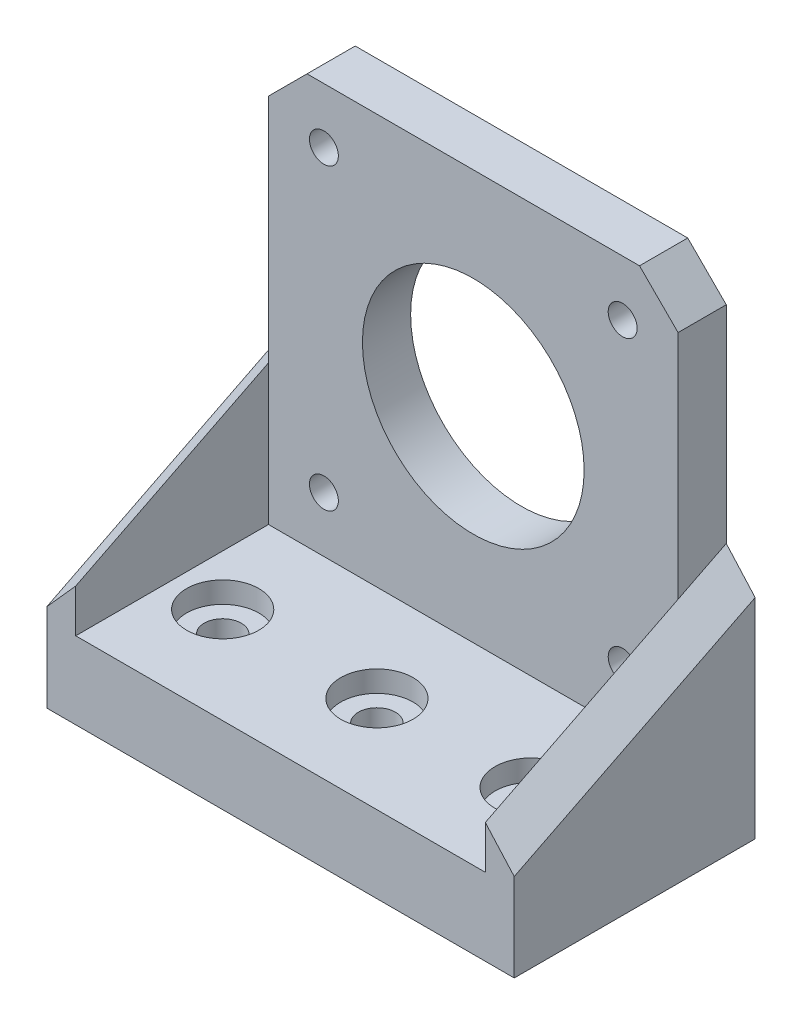
ISO-10303-21;
HEADER;
FILE_DESCRIPTION(('STEP AP214'),'2;1');
FILE_NAME('part.step','',(''),(''),'','','');
FILE_SCHEMA(('AUTOMOTIVE_DESIGN { 1 0 10303 214 1 1 1 1 }'));
ENDSEC;
DATA;
#1=APPLICATION_CONTEXT('core data for automotive mechanical design processes');
#2=APPLICATION_PROTOCOL_DEFINITION('international standard','automotive_design',2000,#1);
#3=PRODUCT_CONTEXT('',#1,'mechanical');
#4=PRODUCT('Part','Part','',(#3));
#5=PRODUCT_RELATED_PRODUCT_CATEGORY('part','',(#4));
#6=PRODUCT_DEFINITION_FORMATION('','',#4);
#7=PRODUCT_DEFINITION_CONTEXT('part definition',#1,'design');
#8=PRODUCT_DEFINITION('design','',#6,#7);
#9=PRODUCT_DEFINITION_SHAPE('','',#8);
#10=(LENGTH_UNIT() NAMED_UNIT(*) SI_UNIT(.MILLI.,.METRE.));
#11=(NAMED_UNIT(*) PLANE_ANGLE_UNIT() SI_UNIT($,.RADIAN.));
#12=(NAMED_UNIT(*) SI_UNIT($,.STERADIAN.) SOLID_ANGLE_UNIT());
#13=UNCERTAINTY_MEASURE_WITH_UNIT(LENGTH_MEASURE(1.E-05),#10,'distance_accuracy_value','');
#14=(GEOMETRIC_REPRESENTATION_CONTEXT(3) GLOBAL_UNCERTAINTY_ASSIGNED_CONTEXT((#13)) GLOBAL_UNIT_ASSIGNED_CONTEXT((#10,
#11,#12)) REPRESENTATION_CONTEXT('',''));
#15=CARTESIAN_POINT('',(0.,0.,0.));
#16=DIRECTION('',(0.,0.,1.));
#17=DIRECTION('',(1.,0.,0.));
#18=AXIS2_PLACEMENT_3D('',#15,#16,#17);
#19=CARTESIAN_POINT('',(21.25,-21.25,5.));
#20=DIRECTION('',(-1.,0.,0.));
#21=DIRECTION('',(0.,0.,1.));
#22=AXIS2_PLACEMENT_3D('',#19,#20,#21);
#23=PLANE('',#22);
#24=DIRECTION('',(0.,1.,0.));
#25=VECTOR('',#24,1.);
#26=CARTESIAN_POINT('',(21.25,-21.25,5.));
#27=LINE('',#26,#25);
#28=CARTESIAN_POINT('',(21.25,-6.71833827664875,5.));
#29=VERTEX_POINT('',#28);
#30=CARTESIAN_POINT('',(21.25,17.25,5.));
#31=VERTEX_POINT('',#30);
#32=EDGE_CURVE('E169',#29,#31,#27,.T.);
#33=ORIENTED_EDGE('',*,*,#32,.F.);
#34=DIRECTION('',(0.,0.449164856844313,-0.893448896902351));
#35=VECTOR('',#34,1.);
#36=CARTESIAN_POINT('',(21.25,-5.107918235039,1.79665942737727));
#37=LINE('',#36,#35);
#38=CARTESIAN_POINT('',(21.25,-4.20468104117844,0.));
#39=VERTEX_POINT('',#38);
#40=EDGE_CURVE('E150',#29,#39,#37,.T.);
#41=ORIENTED_EDGE('',*,*,#40,.T.);
#42=DIRECTION('',(0.,1.,0.));
#43=VECTOR('',#42,1.);
#44=CARTESIAN_POINT('',(21.25,-21.25,0.));
#45=LINE('',#44,#43);
#46=CARTESIAN_POINT('',(21.25,17.25,0.));
#47=VERTEX_POINT('',#46);
#48=EDGE_CURVE('E198',#39,#47,#45,.T.);
#49=ORIENTED_EDGE('',*,*,#48,.T.);
#50=DIRECTION('',(0.,0.,1.));
#51=VECTOR('',#50,1.);
#52=CARTESIAN_POINT('',(21.25,17.25,5.));
#53=LINE('',#52,#51);
#54=EDGE_CURVE('E172',#47,#31,#53,.T.);
#55=ORIENTED_EDGE('',*,*,#54,.T.);
#56=EDGE_LOOP('',(#33,#41,#49,#55));
#57=FACE_BOUND('',#56,.T.);
#58=ADVANCED_FACE('F43',(#57),#23,.F.);
#59=CARTESIAN_POINT('',(0.,0.,5.));
#60=DIRECTION('',(0.,0.,-1.));
#61=DIRECTION('',(-1.,0.,0.));
#62=AXIS2_PLACEMENT_3D('',#59,#60,#61);
#63=PLANE('',#62);
#64=DIRECTION('',(-1.,0.,0.));
#65=VECTOR('',#64,1.);
#66=CARTESIAN_POINT('',(-21.25,21.25,5.));
#67=LINE('',#66,#65);
#68=CARTESIAN_POINT('',(17.25,21.25,5.));
#69=VERTEX_POINT('',#68);
#70=CARTESIAN_POINT('',(-17.25,21.25,5.));
#71=VERTEX_POINT('',#70);
#72=EDGE_CURVE('E207',#69,#71,#67,.T.);
#73=ORIENTED_EDGE('',*,*,#72,.T.);
#74=DIRECTION('',(0.707106781186549,0.707106781186546,0.));
#75=VECTOR('',#74,1.);
#76=CARTESIAN_POINT('',(-21.25,17.25,5.));
#77=LINE('',#76,#75);
#78=CARTESIAN_POINT('',(-21.25,17.25,5.));
#79=VERTEX_POINT('',#78);
#80=EDGE_CURVE('E175',#71,#79,#77,.F.);
#81=ORIENTED_EDGE('',*,*,#80,.T.);
#82=DIRECTION('',(0.,-1.,0.));
#83=VECTOR('',#82,1.);
#84=CARTESIAN_POINT('',(-21.25,-21.25,5.));
#85=LINE('',#84,#83);
#86=CARTESIAN_POINT('',(-21.25,-6.71833827664871,5.));
#87=VERTEX_POINT('',#86);
#88=EDGE_CURVE('E204',#79,#87,#85,.T.);
#89=ORIENTED_EDGE('',*,*,#88,.T.);
#90=CARTESIAN_POINT('',(-21.25,-21.25,5.));
#91=VERTEX_POINT('',#90);
#92=EDGE_CURVE('E206',#87,#91,#85,.T.);
#93=ORIENTED_EDGE('',*,*,#92,.T.);
#94=DIRECTION('',(1.,0.,0.));
#95=VECTOR('',#94,1.);
#96=CARTESIAN_POINT('',(-21.25,-21.25,5.));
#97=LINE('',#96,#95);
#98=CARTESIAN_POINT('',(21.25,-21.25,5.));
#99=VERTEX_POINT('',#98);
#100=EDGE_CURVE('E194',#91,#99,#97,.T.);
#101=ORIENTED_EDGE('',*,*,#100,.T.);
#102=EDGE_CURVE('E210',#99,#29,#27,.T.);
#103=ORIENTED_EDGE('',*,*,#102,.T.);
#104=ORIENTED_EDGE('',*,*,#32,.T.);
#105=DIRECTION('',(0.707106781186546,-0.707106781186549,0.));
#106=VECTOR('',#105,1.);
#107=CARTESIAN_POINT('',(17.25,21.25,5.));
#108=LINE('',#107,#106);
#109=EDGE_CURVE('E180',#31,#69,#108,.F.);
#110=ORIENTED_EDGE('',*,*,#109,.T.);
#111=EDGE_LOOP('',(#73,#81,#89,#93,#101,#103,#104,#110));
#112=FACE_BOUND('',#111,.T.);
#113=CARTESIAN_POINT('',(15.5,15.5,5.));
#114=DIRECTION('',(0.,0.,1.));
#115=DIRECTION('',(1.,0.,0.));
#116=AXIS2_PLACEMENT_3D('',#113,#114,#115);
#117=CIRCLE('',#116,1.5);
#118=CARTESIAN_POINT('',(17.,15.5,5.));
#119=VERTEX_POINT('',#118);
#120=EDGE_CURVE('E201',#119,#119,#117,.T.);
#121=ORIENTED_EDGE('',*,*,#120,.F.);
#122=EDGE_LOOP('',(#121));
#123=FACE_BOUND('',#122,.T.);
#124=CARTESIAN_POINT('',(-15.5,15.5,5.));
#125=DIRECTION('',(0.,0.,1.));
#126=DIRECTION('',(-1.,0.,0.));
#127=AXIS2_PLACEMENT_3D('',#124,#125,#126);
#128=CIRCLE('',#127,1.5);
#129=CARTESIAN_POINT('',(-17.,15.5,5.));
#130=VERTEX_POINT('',#129);
#131=EDGE_CURVE('E215',#130,#130,#128,.T.);
#132=ORIENTED_EDGE('',*,*,#131,.F.);
#133=EDGE_LOOP('',(#132));
#134=FACE_BOUND('',#133,.T.);
#135=CARTESIAN_POINT('',(15.5,-15.5,5.));
#136=DIRECTION('',(0.,0.,1.));
#137=DIRECTION('',(-1.,0.,0.));
#138=AXIS2_PLACEMENT_3D('',#135,#136,#137);
#139=CIRCLE('',#138,1.5);
#140=CARTESIAN_POINT('',(14.,-15.5,5.));
#141=VERTEX_POINT('',#140);
#142=EDGE_CURVE('E221',#141,#141,#139,.T.);
#143=ORIENTED_EDGE('',*,*,#142,.F.);
#144=EDGE_LOOP('',(#143));
#145=FACE_BOUND('',#144,.T.);
#146=CARTESIAN_POINT('',(-15.5,-15.5,5.));
#147=DIRECTION('',(0.,0.,1.));
#148=DIRECTION('',(1.,0.,0.));
#149=AXIS2_PLACEMENT_3D('',#146,#147,#148);
#150=CIRCLE('',#149,1.5);
#151=CARTESIAN_POINT('',(-14.,-15.5,5.));
#152=VERTEX_POINT('',#151);
#153=EDGE_CURVE('E227',#152,#152,#150,.T.);
#154=ORIENTED_EDGE('',*,*,#153,.F.);
#155=EDGE_LOOP('',(#154));
#156=FACE_BOUND('',#155,.T.);
#157=CARTESIAN_POINT('',(0.,0.,5.));
#158=DIRECTION('',(0.,0.,1.));
#159=DIRECTION('',(1.,0.,0.));
#160=AXIS2_PLACEMENT_3D('',#157,#158,#159);
#161=CIRCLE('',#160,11.5);
#162=CARTESIAN_POINT('',(11.5,0.,5.));
#163=VERTEX_POINT('',#162);
#164=EDGE_CURVE('E233',#163,#163,#161,.T.);
#165=ORIENTED_EDGE('',*,*,#164,.F.);
#166=EDGE_LOOP('',(#165));
#167=FACE_BOUND('',#166,.T.);
#168=ADVANCED_FACE('F327',(#112,#123,#134,#145,#156,#167),#63,.F.);
#169=CARTESIAN_POINT('',(0.,0.,0.));
#170=DIRECTION('',(0.,0.,-1.));
#171=DIRECTION('',(-1.,0.,0.));
#172=AXIS2_PLACEMENT_3D('',#169,#170,#171);
#173=PLANE('',#172);
#174=CARTESIAN_POINT('',(-15.5,-15.5,0.));
#175=DIRECTION('',(0.,0.,1.));
#176=DIRECTION('',(1.,0.,0.));
#177=AXIS2_PLACEMENT_3D('',#174,#175,#176);
#178=CIRCLE('',#177,1.5);
#179=CARTESIAN_POINT('',(-14.,-15.5,0.));
#180=VERTEX_POINT('',#179);
#181=EDGE_CURVE('E230',#180,#180,#178,.T.);
#182=ORIENTED_EDGE('',*,*,#181,.T.);
#183=EDGE_LOOP('',(#182));
#184=FACE_BOUND('',#183,.T.);
#185=CARTESIAN_POINT('',(-15.5,15.5,0.));
#186=DIRECTION('',(0.,0.,1.));
#187=DIRECTION('',(-1.,0.,0.));
#188=AXIS2_PLACEMENT_3D('',#185,#186,#187);
#189=CIRCLE('',#188,1.5);
#190=CARTESIAN_POINT('',(-17.,15.5,0.));
#191=VERTEX_POINT('',#190);
#192=EDGE_CURVE('E218',#191,#191,#189,.T.);
#193=ORIENTED_EDGE('',*,*,#192,.T.);
#194=EDGE_LOOP('',(#193));
#195=FACE_BOUND('',#194,.T.);
#196=DIRECTION('',(0.,-1.,0.));
#197=VECTOR('',#196,1.);
#198=CARTESIAN_POINT('',(-21.25,-21.25,0.));
#199=LINE('',#198,#197);
#200=CARTESIAN_POINT('',(-21.25,17.25,0.));
#201=VERTEX_POINT('',#200);
#202=CARTESIAN_POINT('',(-21.25,-4.20468104117839,0.));
#203=VERTEX_POINT('',#202);
#204=EDGE_CURVE('E159',#201,#203,#199,.T.);
#205=ORIENTED_EDGE('',*,*,#204,.F.);
#206=DIRECTION('',(-0.707106781186549,-0.707106781186546,0.));
#207=VECTOR('',#206,1.);
#208=CARTESIAN_POINT('',(-19.25,19.25,0.));
#209=LINE('',#208,#207);
#210=CARTESIAN_POINT('',(-17.25,21.25,0.));
#211=VERTEX_POINT('',#210);
#212=EDGE_CURVE('E189',#201,#211,#209,.F.);
#213=ORIENTED_EDGE('',*,*,#212,.T.);
#214=DIRECTION('',(-1.,0.,0.));
#215=VECTOR('',#214,1.);
#216=CARTESIAN_POINT('',(-21.25,21.25,0.));
#217=LINE('',#216,#215);
#218=CARTESIAN_POINT('',(17.25,21.25,0.));
#219=VERTEX_POINT('',#218);
#220=EDGE_CURVE('E170',#219,#211,#217,.T.);
#221=ORIENTED_EDGE('',*,*,#220,.F.);
#222=DIRECTION('',(-0.707106781186546,0.707106781186549,0.));
#223=VECTOR('',#222,1.);
#224=CARTESIAN_POINT('',(19.25,19.25,0.));
#225=LINE('',#224,#223);
#226=EDGE_CURVE('E191',#219,#47,#225,.F.);
#227=ORIENTED_EDGE('',*,*,#226,.T.);
#228=ORIENTED_EDGE('',*,*,#48,.F.);
#229=DIRECTION('',(-0.666261272608546,0.745718389623081,0.));
#230=VECTOR('',#229,1.);
#231=CARTESIAN_POINT('',(31.4944685695313,-15.6708864448109,0.));
#232=LINE('',#231,#230);
#233=CARTESIAN_POINT('',(24.25,-7.56245562728087,0.));
#234=VERTEX_POINT('',#233);
#235=EDGE_CURVE('E96',#39,#234,#232,.F.);
#236=ORIENTED_EDGE('',*,*,#235,.T.);
#237=DIRECTION('',(0.,1.,0.));
#238=VECTOR('',#237,1.);
#239=CARTESIAN_POINT('',(24.25,-8.68171382264843,0.));
#240=LINE('',#239,#238);
#241=CARTESIAN_POINT('',(24.25,-29.25,0.));
#242=VERTEX_POINT('',#241);
#243=EDGE_CURVE('E59',#242,#234,#240,.T.);
#244=ORIENTED_EDGE('',*,*,#243,.F.);
#245=DIRECTION('',(1.,0.,0.));
#246=VECTOR('',#245,1.);
#247=CARTESIAN_POINT('',(-21.25,-29.25,0.));
#248=LINE('',#247,#246);
#249=CARTESIAN_POINT('',(-24.25,-29.25,0.));
#250=VERTEX_POINT('',#249);
#251=EDGE_CURVE('E242',#250,#242,#248,.T.);
#252=ORIENTED_EDGE('',*,*,#251,.F.);
#253=DIRECTION('',(0.,1.,0.));
#254=VECTOR('',#253,1.);
#255=CARTESIAN_POINT('',(-24.25,-8.68171382264843,0.));
#256=LINE('',#255,#254);
#257=CARTESIAN_POINT('',(-24.25,-7.56245562728089,0.));
#258=VERTEX_POINT('',#257);
#259=EDGE_CURVE('E105',#250,#258,#256,.T.);
#260=ORIENTED_EDGE('',*,*,#259,.T.);
#261=DIRECTION('',(0.666261272608538,0.745718389623087,0.));
#262=VECTOR('',#261,1.);
#263=CARTESIAN_POINT('',(-23.9555136212463,-7.2328493344367,0.));
#264=LINE('',#263,#262);
#265=EDGE_CURVE('E120',#258,#203,#264,.T.);
#266=ORIENTED_EDGE('',*,*,#265,.T.);
#267=EDGE_LOOP('',(#205,#213,#221,#227,#228,#236,#244,#252,#260,#266));
#268=FACE_BOUND('',#267,.T.);
#269=CARTESIAN_POINT('',(15.5,15.5,0.));
#270=DIRECTION('',(0.,0.,1.));
#271=DIRECTION('',(1.,0.,0.));
#272=AXIS2_PLACEMENT_3D('',#269,#270,#271);
#273=CIRCLE('',#272,1.5);
#274=CARTESIAN_POINT('',(17.,15.5,0.));
#275=VERTEX_POINT('',#274);
#276=EDGE_CURVE('E212',#275,#275,#273,.T.);
#277=ORIENTED_EDGE('',*,*,#276,.T.);
#278=EDGE_LOOP('',(#277));
#279=FACE_BOUND('',#278,.T.);
#280=CARTESIAN_POINT('',(15.5,-15.5,0.));
#281=DIRECTION('',(0.,0.,1.));
#282=DIRECTION('',(-1.,0.,0.));
#283=AXIS2_PLACEMENT_3D('',#280,#281,#282);
#284=CIRCLE('',#283,1.5);
#285=CARTESIAN_POINT('',(14.,-15.5,0.));
#286=VERTEX_POINT('',#285);
#287=EDGE_CURVE('E224',#286,#286,#284,.T.);
#288=ORIENTED_EDGE('',*,*,#287,.T.);
#289=EDGE_LOOP('',(#288));
#290=FACE_BOUND('',#289,.T.);
#291=CARTESIAN_POINT('',(0.,0.,0.));
#292=DIRECTION('',(0.,0.,1.));
#293=DIRECTION('',(1.,0.,0.));
#294=AXIS2_PLACEMENT_3D('',#291,#292,#293);
#295=CIRCLE('',#294,11.5);
#296=CARTESIAN_POINT('',(11.5,0.,0.));
#297=VERTEX_POINT('',#296);
#298=EDGE_CURVE('E236',#297,#297,#295,.T.);
#299=ORIENTED_EDGE('',*,*,#298,.T.);
#300=EDGE_LOOP('',(#299));
#301=FACE_BOUND('',#300,.T.);
#302=ADVANCED_FACE('F155',(#184,#195,#268,#279,#290,#301),#173,.T.);
#303=CARTESIAN_POINT('',(-21.25,21.25,5.));
#304=DIRECTION('',(0.,-1.,0.));
#305=DIRECTION('',(0.,0.,-1.));
#306=AXIS2_PLACEMENT_3D('',#303,#304,#305);
#307=PLANE('',#306);
#308=ORIENTED_EDGE('',*,*,#220,.T.);
#309=DIRECTION('',(0.,0.,1.));
#310=VECTOR('',#309,1.);
#311=CARTESIAN_POINT('',(-17.25,21.25,5.));
#312=LINE('',#311,#310);
#313=EDGE_CURVE('E183',#211,#71,#312,.T.);
#314=ORIENTED_EDGE('',*,*,#313,.T.);
#315=ORIENTED_EDGE('',*,*,#72,.F.);
#316=DIRECTION('',(0.,0.,-1.));
#317=VECTOR('',#316,1.);
#318=CARTESIAN_POINT('',(17.25,21.25,5.));
#319=LINE('',#318,#317);
#320=EDGE_CURVE('E186',#69,#219,#319,.T.);
#321=ORIENTED_EDGE('',*,*,#320,.T.);
#322=EDGE_LOOP('',(#308,#314,#315,#321));
#323=FACE_BOUND('',#322,.T.);
#324=ADVANCED_FACE('F390',(#323),#307,.F.);
#325=CARTESIAN_POINT('',(-21.25,-21.25,5.));
#326=DIRECTION('',(1.,0.,0.));
#327=DIRECTION('',(0.,0.,-1.));
#328=AXIS2_PLACEMENT_3D('',#325,#326,#327);
#329=PLANE('',#328);
#330=ORIENTED_EDGE('',*,*,#204,.T.);
#331=DIRECTION('',(0.,-0.449164856844313,0.893448896902351));
#332=VECTOR('',#331,1.);
#333=CARTESIAN_POINT('',(-21.25,-9.65008749489346,10.8316407998567));
#334=LINE('',#333,#332);
#335=EDGE_CURVE('E165',#203,#87,#334,.T.);
#336=ORIENTED_EDGE('',*,*,#335,.T.);
#337=ORIENTED_EDGE('',*,*,#88,.F.);
#338=DIRECTION('',(0.,0.,-1.));
#339=VECTOR('',#338,1.);
#340=CARTESIAN_POINT('',(-21.25,17.25,5.));
#341=LINE('',#340,#339);
#342=EDGE_CURVE('E168',#79,#201,#341,.T.);
#343=ORIENTED_EDGE('',*,*,#342,.T.);
#344=EDGE_LOOP('',(#330,#336,#337,#343));
#345=FACE_BOUND('',#344,.T.);
#346=ADVANCED_FACE('F163',(#345),#329,.F.);
#347=CARTESIAN_POINT('',(15.5,15.5,5.));
#348=DIRECTION('',(0.,0.,-1.));
#349=DIRECTION('',(-1.,0.,0.));
#350=AXIS2_PLACEMENT_3D('',#347,#348,#349);
#351=CYLINDRICAL_SURFACE('',#350,1.5);
#352=ORIENTED_EDGE('',*,*,#120,.T.);
#353=EDGE_LOOP('',(#352));
#354=FACE_BOUND('',#353,.T.);
#355=ORIENTED_EDGE('',*,*,#276,.F.);
#356=EDGE_LOOP('',(#355));
#357=FACE_BOUND('',#356,.T.);
#358=ADVANCED_FACE('F595',(#354,#357),#351,.F.);
#359=CARTESIAN_POINT('',(-15.5,15.5,5.));
#360=DIRECTION('',(0.,0.,-1.));
#361=DIRECTION('',(-1.,0.,0.));
#362=AXIS2_PLACEMENT_3D('',#359,#360,#361);
#363=CYLINDRICAL_SURFACE('',#362,1.5);
#364=ORIENTED_EDGE('',*,*,#131,.T.);
#365=EDGE_LOOP('',(#364));
#366=FACE_BOUND('',#365,.T.);
#367=ORIENTED_EDGE('',*,*,#192,.F.);
#368=EDGE_LOOP('',(#367));
#369=FACE_BOUND('',#368,.T.);
#370=ADVANCED_FACE('F597',(#366,#369),#363,.F.);
#371=CARTESIAN_POINT('',(15.5,-15.5,5.));
#372=DIRECTION('',(0.,0.,-1.));
#373=DIRECTION('',(-1.,0.,0.));
#374=AXIS2_PLACEMENT_3D('',#371,#372,#373);
#375=CYLINDRICAL_SURFACE('',#374,1.5);
#376=ORIENTED_EDGE('',*,*,#142,.T.);
#377=EDGE_LOOP('',(#376));
#378=FACE_BOUND('',#377,.T.);
#379=ORIENTED_EDGE('',*,*,#287,.F.);
#380=EDGE_LOOP('',(#379));
#381=FACE_BOUND('',#380,.T.);
#382=ADVANCED_FACE('F605',(#378,#381),#375,.F.);
#383=CARTESIAN_POINT('',(-15.5,-15.5,5.));
#384=DIRECTION('',(0.,0.,-1.));
#385=DIRECTION('',(-1.,0.,0.));
#386=AXIS2_PLACEMENT_3D('',#383,#384,#385);
#387=CYLINDRICAL_SURFACE('',#386,1.5);
#388=ORIENTED_EDGE('',*,*,#153,.T.);
#389=EDGE_LOOP('',(#388));
#390=FACE_BOUND('',#389,.T.);
#391=ORIENTED_EDGE('',*,*,#181,.F.);
#392=EDGE_LOOP('',(#391));
#393=FACE_BOUND('',#392,.T.);
#394=ADVANCED_FACE('F609',(#390,#393),#387,.F.);
#395=CARTESIAN_POINT('',(0.,0.,5.));
#396=DIRECTION('',(0.,0.,-1.));
#397=DIRECTION('',(-1.,0.,0.));
#398=AXIS2_PLACEMENT_3D('',#395,#396,#397);
#399=CYLINDRICAL_SURFACE('',#398,11.5);
#400=ORIENTED_EDGE('',*,*,#164,.T.);
#401=EDGE_LOOP('',(#400));
#402=FACE_BOUND('',#401,.T.);
#403=ORIENTED_EDGE('',*,*,#298,.F.);
#404=EDGE_LOOP('',(#403));
#405=FACE_BOUND('',#404,.T.);
#406=ADVANCED_FACE('F399',(#402,#405),#399,.F.);
#407=CARTESIAN_POINT('',(-21.25,17.25,5.));
#408=DIRECTION('',(0.707106781186546,-0.707106781186549,0.));
#409=DIRECTION('',(0.,0.,-1.));
#410=AXIS2_PLACEMENT_3D('',#407,#408,#409);
#411=PLANE('',#410);
#412=ORIENTED_EDGE('',*,*,#80,.F.);
#413=ORIENTED_EDGE('',*,*,#313,.F.);
#414=ORIENTED_EDGE('',*,*,#212,.F.);
#415=ORIENTED_EDGE('',*,*,#342,.F.);
#416=EDGE_LOOP('',(#412,#413,#414,#415));
#417=FACE_BOUND('',#416,.T.);
#418=ADVANCED_FACE('F393',(#417),#411,.F.);
#419=CARTESIAN_POINT('',(17.25,21.25,5.));
#420=DIRECTION('',(-0.707106781186549,-0.707106781186546,0.));
#421=DIRECTION('',(0.,0.,-1.));
#422=AXIS2_PLACEMENT_3D('',#419,#420,#421);
#423=PLANE('',#422);
#424=ORIENTED_EDGE('',*,*,#109,.F.);
#425=ORIENTED_EDGE('',*,*,#54,.F.);
#426=ORIENTED_EDGE('',*,*,#226,.F.);
#427=ORIENTED_EDGE('',*,*,#320,.F.);
#428=EDGE_LOOP('',(#424,#425,#426,#427));
#429=FACE_BOUND('',#428,.T.);
#430=ADVANCED_FACE('F313',(#429),#423,.F.);
#431=CARTESIAN_POINT('',(0.,-21.25,0.));
#432=DIRECTION('',(0.,1.,0.));
#433=DIRECTION('',(0.,0.,1.));
#434=AXIS2_PLACEMENT_3D('',#431,#432,#433);
#435=PLANE('',#434);
#436=CARTESIAN_POINT('',(-16.,-21.25,15.0000000000001));
#437=DIRECTION('',(0.,1.,0.));
#438=DIRECTION('',(0.,0.,1.));
#439=AXIS2_PLACEMENT_3D('',#436,#437,#438);
#440=CIRCLE('',#439,3.75);
#441=CARTESIAN_POINT('',(-16.,-21.25,18.7500000000001));
#442=VERTEX_POINT('',#441);
#443=EDGE_CURVE('E267',#442,#442,#440,.T.);
#444=ORIENTED_EDGE('',*,*,#443,.F.);
#445=EDGE_LOOP('',(#444));
#446=FACE_BOUND('',#445,.T.);
#447=CARTESIAN_POINT('',(16.,-21.25,15.));
#448=DIRECTION('',(0.,1.,0.));
#449=DIRECTION('',(0.,0.,1.));
#450=AXIS2_PLACEMENT_3D('',#447,#448,#449);
#451=CIRCLE('',#450,3.75);
#452=CARTESIAN_POINT('',(16.,-21.25,18.75));
#453=VERTEX_POINT('',#452);
#454=EDGE_CURVE('E261',#453,#453,#451,.T.);
#455=ORIENTED_EDGE('',*,*,#454,.F.);
#456=EDGE_LOOP('',(#455));
#457=FACE_BOUND('',#456,.T.);
#458=CARTESIAN_POINT('',(0.,-21.25,15.));
#459=DIRECTION('',(0.,1.,0.));
#460=DIRECTION('',(0.,0.,1.));
#461=AXIS2_PLACEMENT_3D('',#458,#459,#460);
#462=CIRCLE('',#461,3.75);
#463=CARTESIAN_POINT('',(0.,-21.25,18.75));
#464=VERTEX_POINT('',#463);
#465=EDGE_CURVE('E258',#464,#464,#462,.T.);
#466=ORIENTED_EDGE('',*,*,#465,.F.);
#467=EDGE_LOOP('',(#466));
#468=FACE_BOUND('',#467,.T.);
#469=ORIENTED_EDGE('',*,*,#100,.F.);
#470=DIRECTION('',(0.,0.,-1.));
#471=VECTOR('',#470,1.);
#472=CARTESIAN_POINT('',(-21.25,-21.25,0.));
#473=LINE('',#472,#471);
#474=CARTESIAN_POINT('',(-21.25,-21.25,25.));
#475=VERTEX_POINT('',#474);
#476=EDGE_CURVE('E246',#475,#91,#473,.T.);
#477=ORIENTED_EDGE('',*,*,#476,.F.);
#478=DIRECTION('',(-1.,0.,0.));
#479=VECTOR('',#478,1.);
#480=CARTESIAN_POINT('',(-21.25,-21.25,25.));
#481=LINE('',#480,#479);
#482=CARTESIAN_POINT('',(21.25,-21.25,25.));
#483=VERTEX_POINT('',#482);
#484=EDGE_CURVE('E136',#483,#475,#481,.T.);
#485=ORIENTED_EDGE('',*,*,#484,.F.);
#486=DIRECTION('',(0.,0.,1.));
#487=VECTOR('',#486,1.);
#488=CARTESIAN_POINT('',(21.25,-21.25,0.));
#489=LINE('',#488,#487);
#490=EDGE_CURVE('E243',#99,#483,#489,.T.);
#491=ORIENTED_EDGE('',*,*,#490,.F.);
#492=EDGE_LOOP('',(#469,#477,#485,#491));
#493=FACE_BOUND('',#492,.T.);
#494=ADVANCED_FACE('F310',(#446,#457,#468,#493),#435,.T.);
#495=CARTESIAN_POINT('',(-21.25,-29.25,25.));
#496=DIRECTION('',(0.,0.,-1.));
#497=DIRECTION('',(-1.,0.,0.));
#498=AXIS2_PLACEMENT_3D('',#495,#496,#497);
#499=PLANE('',#498);
#500=ORIENTED_EDGE('',*,*,#484,.T.);
#501=DIRECTION('',(0.,1.,0.));
#502=VECTOR('',#501,1.);
#503=CARTESIAN_POINT('',(-21.25,-29.25,25.));
#504=LINE('',#503,#502);
#505=CARTESIAN_POINT('',(-21.25,-16.77296721853,25.));
#506=VERTEX_POINT('',#505);
#507=EDGE_CURVE('E52',#475,#506,#504,.T.);
#508=ORIENTED_EDGE('',*,*,#507,.T.);
#509=DIRECTION('',(-0.666261272608538,-0.745718389623087,0.));
#510=VECTOR('',#509,1.);
#511=CARTESIAN_POINT('',(-27.4491299327112,-23.7113941998649,25.));
#512=LINE('',#511,#510);
#513=CARTESIAN_POINT('',(-24.25,-20.1307418046325,25.));
#514=VERTEX_POINT('',#513);
#515=EDGE_CURVE('E132',#506,#514,#512,.T.);
#516=ORIENTED_EDGE('',*,*,#515,.T.);
#517=DIRECTION('',(0.,-1.,0.));
#518=VECTOR('',#517,1.);
#519=CARTESIAN_POINT('',(-24.25,-29.25,25.));
#520=LINE('',#519,#518);
#521=CARTESIAN_POINT('',(-24.25,-29.25,25.));
#522=VERTEX_POINT('',#521);
#523=EDGE_CURVE('E86',#514,#522,#520,.T.);
#524=ORIENTED_EDGE('',*,*,#523,.T.);
#525=DIRECTION('',(-1.,0.,0.));
#526=VECTOR('',#525,1.);
#527=CARTESIAN_POINT('',(-21.25,-29.25,25.));
#528=LINE('',#527,#526);
#529=CARTESIAN_POINT('',(24.25,-29.25,25.));
#530=VERTEX_POINT('',#529);
#531=EDGE_CURVE('E113',#530,#522,#528,.T.);
#532=ORIENTED_EDGE('',*,*,#531,.F.);
#533=DIRECTION('',(0.,-1.,0.));
#534=VECTOR('',#533,1.);
#535=CARTESIAN_POINT('',(24.25,-29.25,25.));
#536=LINE('',#535,#534);
#537=CARTESIAN_POINT('',(24.25,-20.1307418046324,25.));
#538=VERTEX_POINT('',#537);
#539=EDGE_CURVE('E108',#538,#530,#536,.T.);
#540=ORIENTED_EDGE('',*,*,#539,.F.);
#541=DIRECTION('',(0.666261272608546,-0.745718389623081,0.));
#542=VECTOR('',#541,1.);
#543=CARTESIAN_POINT('',(8.58320638914789,-2.59555466055537,25.));
#544=LINE('',#543,#542);
#545=CARTESIAN_POINT('',(21.25,-16.77296721853,25.));
#546=VERTEX_POINT('',#545);
#547=EDGE_CURVE('E68',#538,#546,#544,.F.);
#548=ORIENTED_EDGE('',*,*,#547,.T.);
#549=DIRECTION('',(0.,1.,0.));
#550=VECTOR('',#549,1.);
#551=CARTESIAN_POINT('',(21.25,0.,25.));
#552=LINE('',#551,#550);
#553=EDGE_CURVE('E11',#483,#546,#552,.T.);
#554=ORIENTED_EDGE('',*,*,#553,.F.);
#555=EDGE_LOOP('',(#500,#508,#516,#524,#532,#540,#548,#554));
#556=FACE_BOUND('',#555,.T.);
#557=ADVANCED_FACE('F110',(#556),#499,.F.);
#558=CARTESIAN_POINT('',(0.,-29.25,0.));
#559=DIRECTION('',(0.,1.,0.));
#560=DIRECTION('',(0.,0.,1.));
#561=AXIS2_PLACEMENT_3D('',#558,#559,#560);
#562=PLANE('',#561);
#563=CARTESIAN_POINT('',(-16.,-29.25,15.0000000000001));
#564=DIRECTION('',(0.,1.,0.));
#565=DIRECTION('',(0.,0.,1.));
#566=AXIS2_PLACEMENT_3D('',#563,#564,#565);
#567=CIRCLE('',#566,1.925);
#568=CARTESIAN_POINT('',(-16.,-29.25,16.9250000000001));
#569=VERTEX_POINT('',#568);
#570=EDGE_CURVE('E282',#569,#569,#567,.T.);
#571=ORIENTED_EDGE('',*,*,#570,.T.);
#572=EDGE_LOOP('',(#571));
#573=FACE_BOUND('',#572,.T.);
#574=CARTESIAN_POINT('',(16.,-29.25,15.));
#575=DIRECTION('',(0.,1.,0.));
#576=DIRECTION('',(0.,0.,1.));
#577=AXIS2_PLACEMENT_3D('',#574,#575,#576);
#578=CIRCLE('',#577,1.925);
#579=CARTESIAN_POINT('',(16.,-29.25,16.925));
#580=VERTEX_POINT('',#579);
#581=EDGE_CURVE('E288',#580,#580,#578,.T.);
#582=ORIENTED_EDGE('',*,*,#581,.T.);
#583=EDGE_LOOP('',(#582));
#584=FACE_BOUND('',#583,.T.);
#585=CARTESIAN_POINT('',(0.,-29.25,15.));
#586=DIRECTION('',(0.,1.,0.));
#587=DIRECTION('',(0.,0.,1.));
#588=AXIS2_PLACEMENT_3D('',#585,#586,#587);
#589=CIRCLE('',#588,1.925);
#590=CARTESIAN_POINT('',(0.,-29.25,16.925));
#591=VERTEX_POINT('',#590);
#592=EDGE_CURVE('E268',#591,#591,#589,.T.);
#593=ORIENTED_EDGE('',*,*,#592,.T.);
#594=EDGE_LOOP('',(#593));
#595=FACE_BOUND('',#594,.T.);
#596=ORIENTED_EDGE('',*,*,#531,.T.);
#597=DIRECTION('',(0.,0.,-1.));
#598=VECTOR('',#597,1.);
#599=CARTESIAN_POINT('',(-24.25,-29.25,0.));
#600=LINE('',#599,#598);
#601=EDGE_CURVE('E116',#522,#250,#600,.T.);
#602=ORIENTED_EDGE('',*,*,#601,.T.);
#603=ORIENTED_EDGE('',*,*,#251,.T.);
#604=DIRECTION('',(0.,0.,-1.));
#605=VECTOR('',#604,1.);
#606=CARTESIAN_POINT('',(24.25,-29.25,0.));
#607=LINE('',#606,#605);
#608=EDGE_CURVE('E115',#530,#242,#607,.T.);
#609=ORIENTED_EDGE('',*,*,#608,.F.);
#610=EDGE_LOOP('',(#596,#602,#603,#609));
#611=FACE_BOUND('',#610,.T.);
#612=ADVANCED_FACE('F367',(#573,#584,#595,#611),#562,.F.);
#613=CARTESIAN_POINT('',(24.25,0.,0.));
#614=DIRECTION('',(1.,0.,0.));
#615=DIRECTION('',(0.,0.,-1.));
#616=AXIS2_PLACEMENT_3D('',#613,#614,#615);
#617=PLANE('',#616);
#618=ORIENTED_EDGE('',*,*,#539,.T.);
#619=ORIENTED_EDGE('',*,*,#608,.T.);
#620=ORIENTED_EDGE('',*,*,#243,.T.);
#621=DIRECTION('',(0.,0.449164856844313,-0.893448896902351));
#622=VECTOR('',#621,1.);
#623=CARTESIAN_POINT('',(24.25,-20.3565511030976,25.4491648568443));
#624=LINE('',#623,#622);
#625=EDGE_CURVE('E118',#234,#538,#624,.F.);
#626=ORIENTED_EDGE('',*,*,#625,.T.);
#627=EDGE_LOOP('',(#618,#619,#620,#626));
#628=FACE_BOUND('',#627,.T.);
#629=ADVANCED_FACE('F119',(#628),#617,.T.);
#630=CARTESIAN_POINT('',(21.25,0.,0.));
#631=DIRECTION('',(1.,0.,0.));
#632=DIRECTION('',(0.,0.,-1.));
#633=AXIS2_PLACEMENT_3D('',#630,#631,#632);
#634=PLANE('',#633);
#635=ORIENTED_EDGE('',*,*,#102,.F.);
#636=ORIENTED_EDGE('',*,*,#490,.T.);
#637=ORIENTED_EDGE('',*,*,#553,.T.);
#638=DIRECTION('',(0.,-0.449164856844313,0.893448896902351));
#639=VECTOR('',#638,1.);
#640=CARTESIAN_POINT('',(21.25,-3.35639055725981,-1.68736308186407));
#641=LINE('',#640,#639);
#642=EDGE_CURVE('E124',#546,#29,#641,.F.);
#643=ORIENTED_EDGE('',*,*,#642,.T.);
#644=EDGE_LOOP('',(#635,#636,#637,#643));
#645=FACE_BOUND('',#644,.T.);
#646=ADVANCED_FACE('F334',(#645),#634,.F.);
#647=CARTESIAN_POINT('',(-24.25,0.,0.));
#648=DIRECTION('',(-1.,0.,0.));
#649=DIRECTION('',(0.,0.,-1.));
#650=AXIS2_PLACEMENT_3D('',#647,#648,#649);
#651=PLANE('',#650);
#652=ORIENTED_EDGE('',*,*,#523,.F.);
#653=DIRECTION('',(0.,0.449164856844313,-0.893448896902351));
#654=VECTOR('',#653,1.);
#655=CARTESIAN_POINT('',(-24.25,-12.3304341856005,9.48414622932378));
#656=LINE('',#655,#654);
#657=EDGE_CURVE('E147',#514,#258,#656,.T.);
#658=ORIENTED_EDGE('',*,*,#657,.T.);
#659=ORIENTED_EDGE('',*,*,#259,.F.);
#660=ORIENTED_EDGE('',*,*,#601,.F.);
#661=EDGE_LOOP('',(#652,#658,#659,#660));
#662=FACE_BOUND('',#661,.T.);
#663=ADVANCED_FACE('F366',(#662),#651,.T.);
#664=CARTESIAN_POINT('',(-21.25,0.,0.));
#665=DIRECTION('',(-1.,0.,0.));
#666=DIRECTION('',(0.,0.,-1.));
#667=AXIS2_PLACEMENT_3D('',#664,#665,#666);
#668=PLANE('',#667);
#669=ORIENTED_EDGE('',*,*,#92,.F.);
#670=DIRECTION('',(0.,-0.449164856844313,0.893448896902351));
#671=VECTOR('',#670,1.);
#672=CARTESIAN_POINT('',(-21.25,-3.35639055725977,-1.68736308186405));
#673=LINE('',#672,#671);
#674=EDGE_CURVE('E145',#87,#506,#673,.T.);
#675=ORIENTED_EDGE('',*,*,#674,.T.);
#676=ORIENTED_EDGE('',*,*,#507,.F.);
#677=ORIENTED_EDGE('',*,*,#476,.T.);
#678=EDGE_LOOP('',(#669,#675,#676,#677));
#679=FACE_BOUND('',#678,.T.);
#680=ADVANCED_FACE('F407',(#679),#668,.F.);
#681=CARTESIAN_POINT('',(-21.25,-9.65008749489346,10.8316407998567));
#682=DIRECTION('',(0.707106781186551,-0.63176377364329,-0.317607516145297));
#683=DIRECTION('',(0.,-0.449164856844313,0.893448896902351));
#684=AXIS2_PLACEMENT_3D('',#681,#682,#683);
#685=PLANE('',#684);
#686=ORIENTED_EDGE('',*,*,#265,.F.);
#687=ORIENTED_EDGE('',*,*,#657,.F.);
#688=ORIENTED_EDGE('',*,*,#515,.F.);
#689=ORIENTED_EDGE('',*,*,#674,.F.);
#690=ORIENTED_EDGE('',*,*,#335,.F.);
#691=EDGE_LOOP('',(#686,#687,#688,#689,#690));
#692=FACE_BOUND('',#691,.T.);
#693=ADVANCED_FACE('F143',(#692),#685,.F.);
#694=CARTESIAN_POINT('',(25.2500000000001,-21.25,25.));
#695=DIRECTION('',(0.707106781186544,0.631763773643296,0.3176075161453));
#696=DIRECTION('',(0.,0.449164856844313,-0.893448896902351));
#697=AXIS2_PLACEMENT_3D('',#694,#695,#696);
#698=PLANE('',#697);
#699=ORIENTED_EDGE('',*,*,#235,.F.);
#700=ORIENTED_EDGE('',*,*,#40,.F.);
#701=ORIENTED_EDGE('',*,*,#642,.F.);
#702=ORIENTED_EDGE('',*,*,#547,.F.);
#703=ORIENTED_EDGE('',*,*,#625,.F.);
#704=EDGE_LOOP('',(#699,#700,#701,#702,#703));
#705=FACE_BOUND('',#704,.T.);
#706=ADVANCED_FACE('F46',(#705),#698,.T.);
#707=CARTESIAN_POINT('',(0.,-23.45,15.));
#708=DIRECTION('',(0.,1.,0.));
#709=DIRECTION('',(0.,0.,1.));
#710=AXIS2_PLACEMENT_3D('',#707,#708,#709);
#711=CYLINDRICAL_SURFACE('',#710,3.75);
#712=CARTESIAN_POINT('',(0.,-23.45,15.));
#713=DIRECTION('',(0.,1.,0.));
#714=DIRECTION('',(0.,0.,1.));
#715=AXIS2_PLACEMENT_3D('',#712,#713,#714);
#716=CIRCLE('',#715,3.75);
#717=CARTESIAN_POINT('',(0.,-23.45,18.75));
#718=VERTEX_POINT('',#717);
#719=EDGE_CURVE('E257',#718,#718,#716,.T.);
#720=ORIENTED_EDGE('',*,*,#719,.F.);
#721=EDGE_LOOP('',(#720));
#722=FACE_BOUND('',#721,.T.);
#723=ORIENTED_EDGE('',*,*,#465,.T.);
#724=EDGE_LOOP('',(#723));
#725=FACE_BOUND('',#724,.T.);
#726=ADVANCED_FACE('F412',(#722,#725),#711,.F.);
#727=CARTESIAN_POINT('',(0.,-23.45,15.));
#728=DIRECTION('',(0.,1.,0.));
#729=DIRECTION('',(0.,0.,1.));
#730=AXIS2_PLACEMENT_3D('',#727,#728,#729);
#731=PLANE('',#730);
#732=CARTESIAN_POINT('',(0.,-23.45,15.));
#733=DIRECTION('',(0.,1.,0.));
#734=DIRECTION('',(0.,0.,1.));
#735=AXIS2_PLACEMENT_3D('',#732,#733,#734);
#736=CIRCLE('',#735,1.925);
#737=CARTESIAN_POINT('',(0.,-23.45,16.925));
#738=VERTEX_POINT('',#737);
#739=EDGE_CURVE('E276',#738,#738,#736,.T.);
#740=ORIENTED_EDGE('',*,*,#739,.F.);
#741=EDGE_LOOP('',(#740));
#742=FACE_BOUND('',#741,.T.);
#743=ORIENTED_EDGE('',*,*,#719,.T.);
#744=EDGE_LOOP('',(#743));
#745=FACE_BOUND('',#744,.T.);
#746=ADVANCED_FACE('F306',(#742,#745),#731,.T.);
#747=CARTESIAN_POINT('',(16.,-23.45,15.));
#748=DIRECTION('',(0.,1.,0.));
#749=DIRECTION('',(0.,0.,1.));
#750=AXIS2_PLACEMENT_3D('',#747,#748,#749);
#751=CYLINDRICAL_SURFACE('',#750,3.75);
#752=CARTESIAN_POINT('',(16.,-23.45,15.));
#753=DIRECTION('',(0.,1.,0.));
#754=DIRECTION('',(0.,0.,1.));
#755=AXIS2_PLACEMENT_3D('',#752,#753,#754);
#756=CIRCLE('',#755,3.75);
#757=CARTESIAN_POINT('',(16.,-23.45,18.75));
#758=VERTEX_POINT('',#757);
#759=EDGE_CURVE('E271',#758,#758,#756,.T.);
#760=ORIENTED_EDGE('',*,*,#759,.F.);
#761=EDGE_LOOP('',(#760));
#762=FACE_BOUND('',#761,.T.);
#763=ORIENTED_EDGE('',*,*,#454,.T.);
#764=EDGE_LOOP('',(#763));
#765=FACE_BOUND('',#764,.T.);
#766=ADVANCED_FACE('F300',(#762,#765),#751,.F.);
#767=CARTESIAN_POINT('',(16.,-23.45,15.));
#768=DIRECTION('',(0.,1.,0.));
#769=DIRECTION('',(0.,0.,1.));
#770=AXIS2_PLACEMENT_3D('',#767,#768,#769);
#771=PLANE('',#770);
#772=CARTESIAN_POINT('',(16.,-23.45,15.));
#773=DIRECTION('',(0.,1.,0.));
#774=DIRECTION('',(0.,0.,1.));
#775=AXIS2_PLACEMENT_3D('',#772,#773,#774);
#776=CIRCLE('',#775,1.925);
#777=CARTESIAN_POINT('',(16.,-23.45,16.925));
#778=VERTEX_POINT('',#777);
#779=EDGE_CURVE('E279',#778,#778,#776,.T.);
#780=ORIENTED_EDGE('',*,*,#779,.F.);
#781=EDGE_LOOP('',(#780));
#782=FACE_BOUND('',#781,.T.);
#783=ORIENTED_EDGE('',*,*,#759,.T.);
#784=EDGE_LOOP('',(#783));
#785=FACE_BOUND('',#784,.T.);
#786=ADVANCED_FACE('F296',(#782,#785),#771,.T.);
#787=CARTESIAN_POINT('',(-16.,-23.45,15.0000000000001));
#788=DIRECTION('',(0.,1.,0.));
#789=DIRECTION('',(0.,0.,1.));
#790=AXIS2_PLACEMENT_3D('',#787,#788,#789);
#791=CYLINDRICAL_SURFACE('',#790,3.75);
#792=CARTESIAN_POINT('',(-16.,-23.45,15.0000000000001));
#793=DIRECTION('',(0.,1.,0.));
#794=DIRECTION('',(0.,0.,1.));
#795=AXIS2_PLACEMENT_3D('',#792,#793,#794);
#796=CIRCLE('',#795,3.75);
#797=CARTESIAN_POINT('',(-16.,-23.45,18.7500000000001));
#798=VERTEX_POINT('',#797);
#799=EDGE_CURVE('E264',#798,#798,#796,.T.);
#800=ORIENTED_EDGE('',*,*,#799,.F.);
#801=EDGE_LOOP('',(#800));
#802=FACE_BOUND('',#801,.T.);
#803=ORIENTED_EDGE('',*,*,#443,.T.);
#804=EDGE_LOOP('',(#803));
#805=FACE_BOUND('',#804,.T.);
#806=ADVANCED_FACE('F299',(#802,#805),#791,.F.);
#807=CARTESIAN_POINT('',(-16.,-23.45,15.0000000000001));
#808=DIRECTION('',(0.,1.,0.));
#809=DIRECTION('',(0.,0.,1.));
#810=AXIS2_PLACEMENT_3D('',#807,#808,#809);
#811=PLANE('',#810);
#812=CARTESIAN_POINT('',(-16.,-23.45,15.0000000000001));
#813=DIRECTION('',(0.,1.,0.));
#814=DIRECTION('',(0.,0.,1.));
#815=AXIS2_PLACEMENT_3D('',#812,#813,#814);
#816=CIRCLE('',#815,1.925);
#817=CARTESIAN_POINT('',(-16.,-23.45,16.9250000000001));
#818=VERTEX_POINT('',#817);
#819=EDGE_CURVE('E285',#818,#818,#816,.T.);
#820=ORIENTED_EDGE('',*,*,#819,.F.);
#821=EDGE_LOOP('',(#820));
#822=FACE_BOUND('',#821,.T.);
#823=ORIENTED_EDGE('',*,*,#799,.T.);
#824=EDGE_LOOP('',(#823));
#825=FACE_BOUND('',#824,.T.);
#826=ADVANCED_FACE('F486',(#822,#825),#811,.T.);
#827=CARTESIAN_POINT('',(0.,-29.25,15.));
#828=DIRECTION('',(0.,1.,0.));
#829=DIRECTION('',(0.,0.,1.));
#830=AXIS2_PLACEMENT_3D('',#827,#828,#829);
#831=CYLINDRICAL_SURFACE('',#830,1.925);
#832=ORIENTED_EDGE('',*,*,#592,.F.);
#833=EDGE_LOOP('',(#832));
#834=FACE_BOUND('',#833,.T.);
#835=ORIENTED_EDGE('',*,*,#739,.T.);
#836=EDGE_LOOP('',(#835));
#837=FACE_BOUND('',#836,.T.);
#838=ADVANCED_FACE('F495',(#834,#837),#831,.F.);
#839=CARTESIAN_POINT('',(16.,-29.25,15.));
#840=DIRECTION('',(0.,1.,0.));
#841=DIRECTION('',(0.,0.,1.));
#842=AXIS2_PLACEMENT_3D('',#839,#840,#841);
#843=CYLINDRICAL_SURFACE('',#842,1.925);
#844=ORIENTED_EDGE('',*,*,#581,.F.);
#845=EDGE_LOOP('',(#844));
#846=FACE_BOUND('',#845,.T.);
#847=ORIENTED_EDGE('',*,*,#779,.T.);
#848=EDGE_LOOP('',(#847));
#849=FACE_BOUND('',#848,.T.);
#850=ADVANCED_FACE('F294',(#846,#849),#843,.F.);
#851=CARTESIAN_POINT('',(-16.,-29.25,15.0000000000001));
#852=DIRECTION('',(0.,1.,0.));
#853=DIRECTION('',(0.,0.,1.));
#854=AXIS2_PLACEMENT_3D('',#851,#852,#853);
#855=CYLINDRICAL_SURFACE('',#854,1.925);
#856=ORIENTED_EDGE('',*,*,#570,.F.);
#857=EDGE_LOOP('',(#856));
#858=FACE_BOUND('',#857,.T.);
#859=ORIENTED_EDGE('',*,*,#819,.T.);
#860=EDGE_LOOP('',(#859));
#861=FACE_BOUND('',#860,.T.);
#862=ADVANCED_FACE('F514',(#858,#861),#855,.F.);
#863=CLOSED_SHELL('',(#58,#168,#302,#324,#346,#358,#370,#382,#394,#406,#418,#430,#494,#557,#612,
#629,#646,#663,#680,#693,#706,#726,#746,#766,#786,#806,#826,#838,#850,#862));
#864=MANIFOLD_SOLID_BREP('B2',#863);
#865=ADVANCED_BREP_SHAPE_REPRESENTATION('',(#18,#864),#14);
#866=SHAPE_DEFINITION_REPRESENTATION(#9,#865);
ENDSEC;
END-ISO-10303-21;
